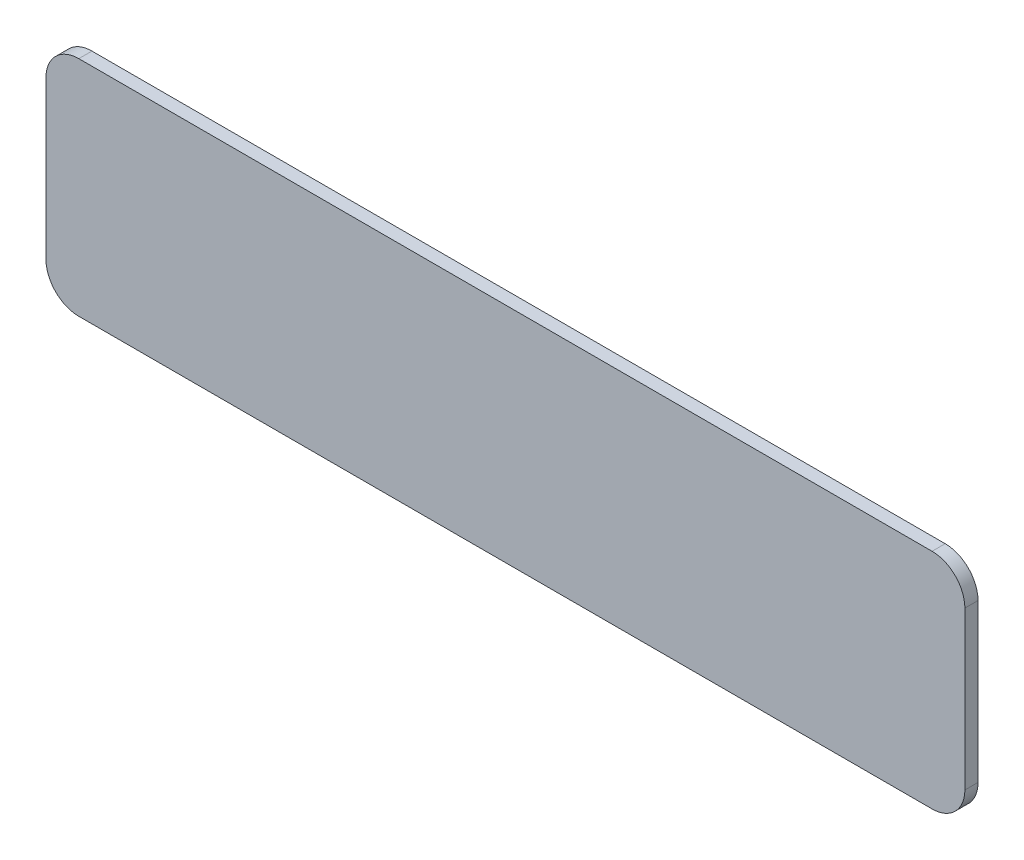
ISO-10303-21;
HEADER;
FILE_DESCRIPTION(('STEP AP214'),'2;1');
FILE_NAME('part.step','',(''),(''),'','','');
FILE_SCHEMA(('AUTOMOTIVE_DESIGN { 1 0 10303 214 1 1 1 1 }'));
ENDSEC;
DATA;
#1=APPLICATION_CONTEXT('core data for automotive mechanical design processes');
#2=APPLICATION_PROTOCOL_DEFINITION('international standard','automotive_design',2000,#1);
#3=PRODUCT_CONTEXT('',#1,'mechanical');
#4=PRODUCT('Part','Part','',(#3));
#5=PRODUCT_RELATED_PRODUCT_CATEGORY('part','',(#4));
#6=PRODUCT_DEFINITION_FORMATION('','',#4);
#7=PRODUCT_DEFINITION_CONTEXT('part definition',#1,'design');
#8=PRODUCT_DEFINITION('design','',#6,#7);
#9=PRODUCT_DEFINITION_SHAPE('','',#8);
#10=(LENGTH_UNIT() NAMED_UNIT(*) SI_UNIT(.MILLI.,.METRE.));
#11=(NAMED_UNIT(*) PLANE_ANGLE_UNIT() SI_UNIT($,.RADIAN.));
#12=(NAMED_UNIT(*) SI_UNIT($,.STERADIAN.) SOLID_ANGLE_UNIT());
#13=UNCERTAINTY_MEASURE_WITH_UNIT(LENGTH_MEASURE(1.E-05),#10,'distance_accuracy_value','');
#14=(GEOMETRIC_REPRESENTATION_CONTEXT(3) GLOBAL_UNCERTAINTY_ASSIGNED_CONTEXT((#13)) GLOBAL_UNIT_ASSIGNED_CONTEXT((#10,
#11,#12)) REPRESENTATION_CONTEXT('',''));
#15=CARTESIAN_POINT('',(0.,0.,0.));
#16=DIRECTION('',(0.,0.,1.));
#17=DIRECTION('',(1.,0.,0.));
#18=AXIS2_PLACEMENT_3D('',#15,#16,#17);
#19=CARTESIAN_POINT('',(65.,12.,2.));
#20=DIRECTION('',(0.,0.,-1.));
#21=DIRECTION('',(-1.,0.,0.));
#22=AXIS2_PLACEMENT_3D('',#19,#20,#21);
#23=CYLINDRICAL_SURFACE('',#22,5.);
#24=CARTESIAN_POINT('',(65.,12.,0.));
#25=DIRECTION('',(0.,0.,1.));
#26=DIRECTION('',(-1.,0.,0.));
#27=AXIS2_PLACEMENT_3D('',#24,#25,#26);
#28=CIRCLE('',#27,5.);
#29=CARTESIAN_POINT('',(70.,12.,0.));
#30=VERTEX_POINT('',#29);
#31=CARTESIAN_POINT('',(65.,17.,0.));
#32=VERTEX_POINT('',#31);
#33=EDGE_CURVE('E131',#30,#32,#28,.T.);
#34=ORIENTED_EDGE('',*,*,#33,.T.);
#35=DIRECTION('',(0.,0.,-1.));
#36=VECTOR('',#35,1.);
#37=CARTESIAN_POINT('',(65.,17.,2.));
#38=LINE('',#37,#36);
#39=CARTESIAN_POINT('',(65.,17.,2.));
#40=VERTEX_POINT('',#39);
#41=EDGE_CURVE('E11',#40,#32,#38,.T.);
#42=ORIENTED_EDGE('',*,*,#41,.F.);
#43=CARTESIAN_POINT('',(65.,12.,2.));
#44=DIRECTION('',(0.,0.,1.));
#45=DIRECTION('',(-1.,0.,0.));
#46=AXIS2_PLACEMENT_3D('',#43,#44,#45);
#47=CIRCLE('',#46,5.);
#48=CARTESIAN_POINT('',(70.,12.,2.));
#49=VERTEX_POINT('',#48);
#50=EDGE_CURVE('E145',#49,#40,#47,.T.);
#51=ORIENTED_EDGE('',*,*,#50,.F.);
#52=DIRECTION('',(0.,0.,-1.));
#53=VECTOR('',#52,1.);
#54=CARTESIAN_POINT('',(70.,12.,2.));
#55=LINE('',#54,#53);
#56=EDGE_CURVE('E127',#49,#30,#55,.T.);
#57=ORIENTED_EDGE('',*,*,#56,.T.);
#58=EDGE_LOOP('',(#34,#42,#51,#57));
#59=FACE_BOUND('',#58,.T.);
#60=ADVANCED_FACE('F35',(#59),#23,.T.);
#61=CARTESIAN_POINT('',(-65.,17.,2.));
#62=DIRECTION('',(0.,-1.,0.));
#63=DIRECTION('',(0.,0.,-1.));
#64=AXIS2_PLACEMENT_3D('',#61,#62,#63);
#65=PLANE('',#64);
#66=DIRECTION('',(-1.,0.,0.));
#67=VECTOR('',#66,1.);
#68=CARTESIAN_POINT('',(-65.,17.,0.));
#69=LINE('',#68,#67);
#70=CARTESIAN_POINT('',(-65.,17.,0.));
#71=VERTEX_POINT('',#70);
#72=EDGE_CURVE('E134',#32,#71,#69,.T.);
#73=ORIENTED_EDGE('',*,*,#72,.T.);
#74=DIRECTION('',(0.,0.,-1.));
#75=VECTOR('',#74,1.);
#76=CARTESIAN_POINT('',(-65.,17.,2.));
#77=LINE('',#76,#75);
#78=CARTESIAN_POINT('',(-65.,17.,2.));
#79=VERTEX_POINT('',#78);
#80=EDGE_CURVE('E43',#79,#71,#77,.T.);
#81=ORIENTED_EDGE('',*,*,#80,.F.);
#82=DIRECTION('',(-1.,0.,0.));
#83=VECTOR('',#82,1.);
#84=CARTESIAN_POINT('',(-65.,17.,2.));
#85=LINE('',#84,#83);
#86=EDGE_CURVE('E94',#40,#79,#85,.T.);
#87=ORIENTED_EDGE('',*,*,#86,.F.);
#88=ORIENTED_EDGE('',*,*,#41,.T.);
#89=EDGE_LOOP('',(#73,#81,#87,#88));
#90=FACE_BOUND('',#89,.T.);
#91=ADVANCED_FACE('F180',(#90),#65,.F.);
#92=CARTESIAN_POINT('',(-65.,12.,2.));
#93=DIRECTION('',(0.,0.,-1.));
#94=DIRECTION('',(-1.,0.,0.));
#95=AXIS2_PLACEMENT_3D('',#92,#93,#94);
#96=CYLINDRICAL_SURFACE('',#95,5.);
#97=CARTESIAN_POINT('',(-65.,12.,0.));
#98=DIRECTION('',(0.,0.,1.));
#99=DIRECTION('',(-1.,0.,0.));
#100=AXIS2_PLACEMENT_3D('',#97,#98,#99);
#101=CIRCLE('',#100,5.);
#102=CARTESIAN_POINT('',(-70.,12.,0.));
#103=VERTEX_POINT('',#102);
#104=EDGE_CURVE('E136',#71,#103,#101,.T.);
#105=ORIENTED_EDGE('',*,*,#104,.T.);
#106=DIRECTION('',(0.,0.,-1.));
#107=VECTOR('',#106,1.);
#108=CARTESIAN_POINT('',(-70.,12.,2.));
#109=LINE('',#108,#107);
#110=CARTESIAN_POINT('',(-70.,12.,2.));
#111=VERTEX_POINT('',#110);
#112=EDGE_CURVE('E152',#111,#103,#109,.T.);
#113=ORIENTED_EDGE('',*,*,#112,.F.);
#114=CARTESIAN_POINT('',(-65.,12.,2.));
#115=DIRECTION('',(0.,0.,1.));
#116=DIRECTION('',(-1.,0.,0.));
#117=AXIS2_PLACEMENT_3D('',#114,#115,#116);
#118=CIRCLE('',#117,5.);
#119=EDGE_CURVE('E160',#79,#111,#118,.T.);
#120=ORIENTED_EDGE('',*,*,#119,.F.);
#121=ORIENTED_EDGE('',*,*,#80,.T.);
#122=EDGE_LOOP('',(#105,#113,#120,#121));
#123=FACE_BOUND('',#122,.T.);
#124=ADVANCED_FACE('F158',(#123),#96,.T.);
#125=CARTESIAN_POINT('',(-70.,12.,2.));
#126=DIRECTION('',(1.,0.,0.));
#127=DIRECTION('',(0.,0.,-1.));
#128=AXIS2_PLACEMENT_3D('',#125,#126,#127);
#129=PLANE('',#128);
#130=DIRECTION('',(0.,-1.,0.));
#131=VECTOR('',#130,1.);
#132=CARTESIAN_POINT('',(-70.,12.,0.));
#133=LINE('',#132,#131);
#134=CARTESIAN_POINT('',(-70.,-12.,0.));
#135=VERTEX_POINT('',#134);
#136=EDGE_CURVE('E138',#103,#135,#133,.T.);
#137=ORIENTED_EDGE('',*,*,#136,.T.);
#138=DIRECTION('',(0.,0.,-1.));
#139=VECTOR('',#138,1.);
#140=CARTESIAN_POINT('',(-70.,-12.,2.));
#141=LINE('',#140,#139);
#142=CARTESIAN_POINT('',(-70.,-12.,2.));
#143=VERTEX_POINT('',#142);
#144=EDGE_CURVE('E149',#143,#135,#141,.T.);
#145=ORIENTED_EDGE('',*,*,#144,.F.);
#146=DIRECTION('',(0.,-1.,0.));
#147=VECTOR('',#146,1.);
#148=CARTESIAN_POINT('',(-70.,12.,2.));
#149=LINE('',#148,#147);
#150=EDGE_CURVE('E172',#111,#143,#149,.T.);
#151=ORIENTED_EDGE('',*,*,#150,.F.);
#152=ORIENTED_EDGE('',*,*,#112,.T.);
#153=EDGE_LOOP('',(#137,#145,#151,#152));
#154=FACE_BOUND('',#153,.T.);
#155=ADVANCED_FACE('F168',(#154),#129,.F.);
#156=CARTESIAN_POINT('',(-65.,-12.,2.));
#157=DIRECTION('',(0.,0.,-1.));
#158=DIRECTION('',(-1.,0.,0.));
#159=AXIS2_PLACEMENT_3D('',#156,#157,#158);
#160=CYLINDRICAL_SURFACE('',#159,5.);
#161=CARTESIAN_POINT('',(-65.,-12.,0.));
#162=DIRECTION('',(0.,0.,1.));
#163=DIRECTION('',(-1.,0.,0.));
#164=AXIS2_PLACEMENT_3D('',#161,#162,#163);
#165=CIRCLE('',#164,5.);
#166=CARTESIAN_POINT('',(-65.,-17.,0.));
#167=VERTEX_POINT('',#166);
#168=EDGE_CURVE('E140',#135,#167,#165,.T.);
#169=ORIENTED_EDGE('',*,*,#168,.T.);
#170=DIRECTION('',(0.,0.,-1.));
#171=VECTOR('',#170,1.);
#172=CARTESIAN_POINT('',(-65.,-17.,2.));
#173=LINE('',#172,#171);
#174=CARTESIAN_POINT('',(-65.,-17.,2.));
#175=VERTEX_POINT('',#174);
#176=EDGE_CURVE('E122',#175,#167,#173,.T.);
#177=ORIENTED_EDGE('',*,*,#176,.F.);
#178=CARTESIAN_POINT('',(-65.,-12.,2.));
#179=DIRECTION('',(0.,0.,1.));
#180=DIRECTION('',(-1.,0.,0.));
#181=AXIS2_PLACEMENT_3D('',#178,#179,#180);
#182=CIRCLE('',#181,5.);
#183=EDGE_CURVE('E113',#143,#175,#182,.T.);
#184=ORIENTED_EDGE('',*,*,#183,.F.);
#185=ORIENTED_EDGE('',*,*,#144,.T.);
#186=EDGE_LOOP('',(#169,#177,#184,#185));
#187=FACE_BOUND('',#186,.T.);
#188=ADVANCED_FACE('F171',(#187),#160,.T.);
#189=CARTESIAN_POINT('',(-65.,-17.,2.));
#190=DIRECTION('',(0.,1.,0.));
#191=DIRECTION('',(0.,0.,1.));
#192=AXIS2_PLACEMENT_3D('',#189,#190,#191);
#193=PLANE('',#192);
#194=DIRECTION('',(1.,0.,0.));
#195=VECTOR('',#194,1.);
#196=CARTESIAN_POINT('',(-65.,-17.,0.));
#197=LINE('',#196,#195);
#198=CARTESIAN_POINT('',(65.,-17.,0.));
#199=VERTEX_POINT('',#198);
#200=EDGE_CURVE('E121',#167,#199,#197,.T.);
#201=ORIENTED_EDGE('',*,*,#200,.T.);
#202=DIRECTION('',(0.,0.,-1.));
#203=VECTOR('',#202,1.);
#204=CARTESIAN_POINT('',(65.,-17.,2.));
#205=LINE('',#204,#203);
#206=CARTESIAN_POINT('',(65.,-17.,2.));
#207=VERTEX_POINT('',#206);
#208=EDGE_CURVE('E118',#207,#199,#205,.T.);
#209=ORIENTED_EDGE('',*,*,#208,.F.);
#210=DIRECTION('',(1.,0.,0.));
#211=VECTOR('',#210,1.);
#212=CARTESIAN_POINT('',(-65.,-17.,2.));
#213=LINE('',#212,#211);
#214=EDGE_CURVE('E107',#175,#207,#213,.T.);
#215=ORIENTED_EDGE('',*,*,#214,.F.);
#216=ORIENTED_EDGE('',*,*,#176,.T.);
#217=EDGE_LOOP('',(#201,#209,#215,#216));
#218=FACE_BOUND('',#217,.T.);
#219=ADVANCED_FACE('F119',(#218),#193,.F.);
#220=CARTESIAN_POINT('',(65.,-12.,2.));
#221=DIRECTION('',(0.,0.,-1.));
#222=DIRECTION('',(-1.,0.,0.));
#223=AXIS2_PLACEMENT_3D('',#220,#221,#222);
#224=CYLINDRICAL_SURFACE('',#223,5.);
#225=CARTESIAN_POINT('',(65.,-12.,0.));
#226=DIRECTION('',(0.,0.,1.));
#227=DIRECTION('',(-1.,0.,0.));
#228=AXIS2_PLACEMENT_3D('',#225,#226,#227);
#229=CIRCLE('',#228,5.);
#230=CARTESIAN_POINT('',(70.,-12.,0.));
#231=VERTEX_POINT('',#230);
#232=EDGE_CURVE('E80',#199,#231,#229,.T.);
#233=ORIENTED_EDGE('',*,*,#232,.T.);
#234=DIRECTION('',(0.,0.,-1.));
#235=VECTOR('',#234,1.);
#236=CARTESIAN_POINT('',(70.,-12.,2.));
#237=LINE('',#236,#235);
#238=CARTESIAN_POINT('',(70.,-12.,2.));
#239=VERTEX_POINT('',#238);
#240=EDGE_CURVE('E123',#239,#231,#237,.T.);
#241=ORIENTED_EDGE('',*,*,#240,.F.);
#242=CARTESIAN_POINT('',(65.,-12.,2.));
#243=DIRECTION('',(0.,0.,1.));
#244=DIRECTION('',(-1.,0.,0.));
#245=AXIS2_PLACEMENT_3D('',#242,#243,#244);
#246=CIRCLE('',#245,5.);
#247=EDGE_CURVE('E111',#207,#239,#246,.T.);
#248=ORIENTED_EDGE('',*,*,#247,.F.);
#249=ORIENTED_EDGE('',*,*,#208,.T.);
#250=EDGE_LOOP('',(#233,#241,#248,#249));
#251=FACE_BOUND('',#250,.T.);
#252=ADVANCED_FACE('F125',(#251),#224,.T.);
#253=CARTESIAN_POINT('',(70.,12.,2.));
#254=DIRECTION('',(-1.,0.,0.));
#255=DIRECTION('',(0.,0.,1.));
#256=AXIS2_PLACEMENT_3D('',#253,#254,#255);
#257=PLANE('',#256);
#258=DIRECTION('',(0.,1.,0.));
#259=VECTOR('',#258,1.);
#260=CARTESIAN_POINT('',(70.,12.,0.));
#261=LINE('',#260,#259);
#262=EDGE_CURVE('E86',#231,#30,#261,.T.);
#263=ORIENTED_EDGE('',*,*,#262,.T.);
#264=ORIENTED_EDGE('',*,*,#56,.F.);
#265=DIRECTION('',(0.,1.,0.));
#266=VECTOR('',#265,1.);
#267=CARTESIAN_POINT('',(70.,12.,2.));
#268=LINE('',#267,#266);
#269=EDGE_CURVE('E51',#239,#49,#268,.T.);
#270=ORIENTED_EDGE('',*,*,#269,.F.);
#271=ORIENTED_EDGE('',*,*,#240,.T.);
#272=EDGE_LOOP('',(#263,#264,#270,#271));
#273=FACE_BOUND('',#272,.T.);
#274=ADVANCED_FACE('F196',(#273),#257,.F.);
#275=CARTESIAN_POINT('',(65.,12.,2.));
#276=DIRECTION('',(0.,0.,-1.));
#277=DIRECTION('',(-1.,0.,0.));
#278=AXIS2_PLACEMENT_3D('',#275,#276,#277);
#279=PLANE('',#278);
#280=ORIENTED_EDGE('',*,*,#50,.T.);
#281=ORIENTED_EDGE('',*,*,#86,.T.);
#282=ORIENTED_EDGE('',*,*,#119,.T.);
#283=ORIENTED_EDGE('',*,*,#150,.T.);
#284=ORIENTED_EDGE('',*,*,#183,.T.);
#285=ORIENTED_EDGE('',*,*,#214,.T.);
#286=ORIENTED_EDGE('',*,*,#247,.T.);
#287=ORIENTED_EDGE('',*,*,#269,.T.);
#288=EDGE_LOOP('',(#280,#281,#282,#283,#284,#285,#286,#287));
#289=FACE_BOUND('',#288,.T.);
#290=ADVANCED_FACE('F109',(#289),#279,.F.);
#291=CARTESIAN_POINT('',(65.,12.,0.));
#292=DIRECTION('',(0.,0.,-1.));
#293=DIRECTION('',(-1.,0.,0.));
#294=AXIS2_PLACEMENT_3D('',#291,#292,#293);
#295=PLANE('',#294);
#296=ORIENTED_EDGE('',*,*,#33,.F.);
#297=ORIENTED_EDGE('',*,*,#262,.F.);
#298=ORIENTED_EDGE('',*,*,#232,.F.);
#299=ORIENTED_EDGE('',*,*,#200,.F.);
#300=ORIENTED_EDGE('',*,*,#168,.F.);
#301=ORIENTED_EDGE('',*,*,#136,.F.);
#302=ORIENTED_EDGE('',*,*,#104,.F.);
#303=ORIENTED_EDGE('',*,*,#72,.F.);
#304=EDGE_LOOP('',(#296,#297,#298,#299,#300,#301,#302,#303));
#305=FACE_BOUND('',#304,.T.);
#306=ADVANCED_FACE('F164',(#305),#295,.T.);
#307=CLOSED_SHELL('',(#60,#91,#124,#155,#188,#219,#252,#274,#290,#306));
#308=MANIFOLD_SOLID_BREP('B2',#307);
#309=ADVANCED_BREP_SHAPE_REPRESENTATION('',(#18,#308),#14);
#310=SHAPE_DEFINITION_REPRESENTATION(#9,#309);
ENDSEC;
END-ISO-10303-21;
